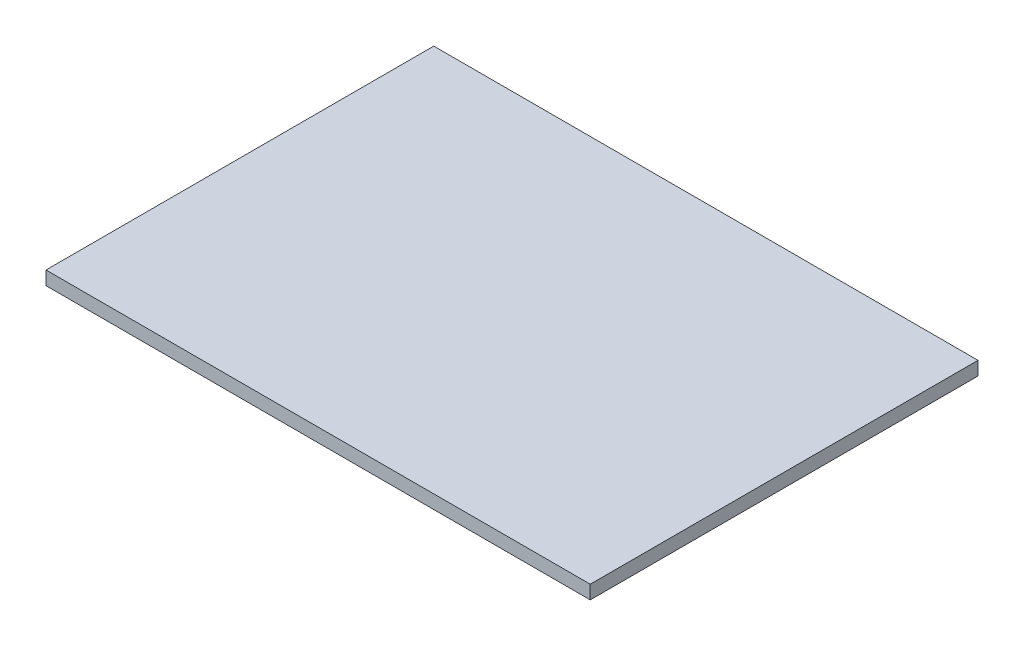
ISO-10303-21;
HEADER;
FILE_DESCRIPTION(('STEP AP214'),'2;1');
FILE_NAME('part.step','',(''),(''),'','','');
FILE_SCHEMA(('AUTOMOTIVE_DESIGN { 1 0 10303 214 1 1 1 1 }'));
ENDSEC;
DATA;
#1=APPLICATION_CONTEXT('core data for automotive mechanical design processes');
#2=APPLICATION_PROTOCOL_DEFINITION('international standard','automotive_design',2000,#1);
#3=PRODUCT_CONTEXT('',#1,'mechanical');
#4=PRODUCT('Part','Part','',(#3));
#5=PRODUCT_RELATED_PRODUCT_CATEGORY('part','',(#4));
#6=PRODUCT_DEFINITION_FORMATION('','',#4);
#7=PRODUCT_DEFINITION_CONTEXT('part definition',#1,'design');
#8=PRODUCT_DEFINITION('design','',#6,#7);
#9=PRODUCT_DEFINITION_SHAPE('','',#8);
#10=(LENGTH_UNIT() NAMED_UNIT(*) SI_UNIT(.MILLI.,.METRE.));
#11=(NAMED_UNIT(*) PLANE_ANGLE_UNIT() SI_UNIT($,.RADIAN.));
#12=(NAMED_UNIT(*) SI_UNIT($,.STERADIAN.) SOLID_ANGLE_UNIT());
#13=UNCERTAINTY_MEASURE_WITH_UNIT(LENGTH_MEASURE(1.E-05),#10,'distance_accuracy_value','');
#14=(GEOMETRIC_REPRESENTATION_CONTEXT(3) GLOBAL_UNCERTAINTY_ASSIGNED_CONTEXT((#13)) GLOBAL_UNIT_ASSIGNED_CONTEXT((#10,
#11,#12)) REPRESENTATION_CONTEXT('',''));
#15=CARTESIAN_POINT('',(0.,0.,0.));
#16=DIRECTION('',(0.,0.,1.));
#17=DIRECTION('',(1.,0.,0.));
#18=AXIS2_PLACEMENT_3D('',#15,#16,#17);
#19=CARTESIAN_POINT('',(400.,20.,285.));
#20=DIRECTION('',(-1.,0.,0.));
#21=DIRECTION('',(0.,0.,1.));
#22=AXIS2_PLACEMENT_3D('',#19,#20,#21);
#23=PLANE('',#22);
#24=DIRECTION('',(0.,0.,-1.));
#25=VECTOR('',#24,1.);
#26=CARTESIAN_POINT('',(400.,0.,285.));
#27=LINE('',#26,#25);
#28=CARTESIAN_POINT('',(400.,0.,285.));
#29=VERTEX_POINT('',#28);
#30=CARTESIAN_POINT('',(400.,0.,-285.));
#31=VERTEX_POINT('',#30);
#32=EDGE_CURVE('E96',#29,#31,#27,.T.);
#33=ORIENTED_EDGE('',*,*,#32,.T.);
#34=DIRECTION('',(0.,-1.,0.));
#35=VECTOR('',#34,1.);
#36=CARTESIAN_POINT('',(400.,20.,-285.));
#37=LINE('',#36,#35);
#38=CARTESIAN_POINT('',(400.,20.,-285.));
#39=VERTEX_POINT('',#38);
#40=EDGE_CURVE('E11',#39,#31,#37,.T.);
#41=ORIENTED_EDGE('',*,*,#40,.F.);
#42=DIRECTION('',(0.,0.,-1.));
#43=VECTOR('',#42,1.);
#44=CARTESIAN_POINT('',(400.,20.,285.));
#45=LINE('',#44,#43);
#46=CARTESIAN_POINT('',(400.,20.,285.));
#47=VERTEX_POINT('',#46);
#48=EDGE_CURVE('E84',#47,#39,#45,.T.);
#49=ORIENTED_EDGE('',*,*,#48,.F.);
#50=DIRECTION('',(0.,-1.,0.));
#51=VECTOR('',#50,1.);
#52=CARTESIAN_POINT('',(400.,20.,285.));
#53=LINE('',#52,#51);
#54=EDGE_CURVE('E92',#47,#29,#53,.T.);
#55=ORIENTED_EDGE('',*,*,#54,.T.);
#56=EDGE_LOOP('',(#33,#41,#49,#55));
#57=FACE_BOUND('',#56,.T.);
#58=ADVANCED_FACE('F33',(#57),#23,.F.);
#59=CARTESIAN_POINT('',(-400.,20.,-285.));
#60=DIRECTION('',(0.,0.,1.));
#61=DIRECTION('',(1.,0.,0.));
#62=AXIS2_PLACEMENT_3D('',#59,#60,#61);
#63=PLANE('',#62);
#64=DIRECTION('',(-1.,0.,0.));
#65=VECTOR('',#64,1.);
#66=CARTESIAN_POINT('',(-400.,0.,-285.));
#67=LINE('',#66,#65);
#68=CARTESIAN_POINT('',(-400.,0.,-285.));
#69=VERTEX_POINT('',#68);
#70=EDGE_CURVE('E88',#31,#69,#67,.T.);
#71=ORIENTED_EDGE('',*,*,#70,.T.);
#72=DIRECTION('',(0.,-1.,0.));
#73=VECTOR('',#72,1.);
#74=CARTESIAN_POINT('',(-400.,20.,-285.));
#75=LINE('',#74,#73);
#76=CARTESIAN_POINT('',(-400.,20.,-285.));
#77=VERTEX_POINT('',#76);
#78=EDGE_CURVE('E41',#77,#69,#75,.T.);
#79=ORIENTED_EDGE('',*,*,#78,.F.);
#80=DIRECTION('',(-1.,0.,0.));
#81=VECTOR('',#80,1.);
#82=CARTESIAN_POINT('',(-400.,20.,-285.));
#83=LINE('',#82,#81);
#84=EDGE_CURVE('E79',#39,#77,#83,.T.);
#85=ORIENTED_EDGE('',*,*,#84,.F.);
#86=ORIENTED_EDGE('',*,*,#40,.T.);
#87=EDGE_LOOP('',(#71,#79,#85,#86));
#88=FACE_BOUND('',#87,.T.);
#89=ADVANCED_FACE('F87',(#88),#63,.F.);
#90=CARTESIAN_POINT('',(-400.,20.,285.));
#91=DIRECTION('',(1.,0.,0.));
#92=DIRECTION('',(0.,0.,-1.));
#93=AXIS2_PLACEMENT_3D('',#90,#91,#92);
#94=PLANE('',#93);
#95=DIRECTION('',(0.,0.,1.));
#96=VECTOR('',#95,1.);
#97=CARTESIAN_POINT('',(-400.,0.,285.));
#98=LINE('',#97,#96);
#99=CARTESIAN_POINT('',(-400.,0.,285.));
#100=VERTEX_POINT('',#99);
#101=EDGE_CURVE('E66',#69,#100,#98,.T.);
#102=ORIENTED_EDGE('',*,*,#101,.T.);
#103=DIRECTION('',(0.,-1.,0.));
#104=VECTOR('',#103,1.);
#105=CARTESIAN_POINT('',(-400.,20.,285.));
#106=LINE('',#105,#104);
#107=CARTESIAN_POINT('',(-400.,20.,285.));
#108=VERTEX_POINT('',#107);
#109=EDGE_CURVE('E89',#108,#100,#106,.T.);
#110=ORIENTED_EDGE('',*,*,#109,.F.);
#111=DIRECTION('',(0.,0.,1.));
#112=VECTOR('',#111,1.);
#113=CARTESIAN_POINT('',(-400.,20.,285.));
#114=LINE('',#113,#112);
#115=EDGE_CURVE('E82',#77,#108,#114,.T.);
#116=ORIENTED_EDGE('',*,*,#115,.F.);
#117=ORIENTED_EDGE('',*,*,#78,.T.);
#118=EDGE_LOOP('',(#102,#110,#116,#117));
#119=FACE_BOUND('',#118,.T.);
#120=ADVANCED_FACE('F90',(#119),#94,.F.);
#121=CARTESIAN_POINT('',(-400.,20.,285.));
#122=DIRECTION('',(0.,0.,-1.));
#123=DIRECTION('',(-1.,0.,0.));
#124=AXIS2_PLACEMENT_3D('',#121,#122,#123);
#125=PLANE('',#124);
#126=DIRECTION('',(1.,0.,0.));
#127=VECTOR('',#126,1.);
#128=CARTESIAN_POINT('',(-400.,0.,285.));
#129=LINE('',#128,#127);
#130=EDGE_CURVE('E72',#100,#29,#129,.T.);
#131=ORIENTED_EDGE('',*,*,#130,.T.);
#132=ORIENTED_EDGE('',*,*,#54,.F.);
#133=DIRECTION('',(1.,0.,0.));
#134=VECTOR('',#133,1.);
#135=CARTESIAN_POINT('',(-400.,20.,285.));
#136=LINE('',#135,#134);
#137=EDGE_CURVE('E49',#108,#47,#136,.T.);
#138=ORIENTED_EDGE('',*,*,#137,.F.);
#139=ORIENTED_EDGE('',*,*,#109,.T.);
#140=EDGE_LOOP('',(#131,#132,#138,#139));
#141=FACE_BOUND('',#140,.T.);
#142=ADVANCED_FACE('F103',(#141),#125,.F.);
#143=CARTESIAN_POINT('',(0.,20.,0.));
#144=DIRECTION('',(0.,-1.,0.));
#145=DIRECTION('',(0.,0.,-1.));
#146=AXIS2_PLACEMENT_3D('',#143,#144,#145);
#147=PLANE('',#146);
#148=ORIENTED_EDGE('',*,*,#48,.T.);
#149=ORIENTED_EDGE('',*,*,#84,.T.);
#150=ORIENTED_EDGE('',*,*,#115,.T.);
#151=ORIENTED_EDGE('',*,*,#137,.T.);
#152=EDGE_LOOP('',(#148,#149,#150,#151));
#153=FACE_BOUND('',#152,.T.);
#154=ADVANCED_FACE('F80',(#153),#147,.F.);
#155=CARTESIAN_POINT('',(0.,0.,0.));
#156=DIRECTION('',(0.,-1.,0.));
#157=DIRECTION('',(0.,0.,-1.));
#158=AXIS2_PLACEMENT_3D('',#155,#156,#157);
#159=PLANE('',#158);
#160=ORIENTED_EDGE('',*,*,#32,.F.);
#161=ORIENTED_EDGE('',*,*,#130,.F.);
#162=ORIENTED_EDGE('',*,*,#101,.F.);
#163=ORIENTED_EDGE('',*,*,#70,.F.);
#164=EDGE_LOOP('',(#160,#161,#162,#163));
#165=FACE_BOUND('',#164,.T.);
#166=ADVANCED_FACE('F106',(#165),#159,.T.);
#167=CLOSED_SHELL('',(#58,#89,#120,#142,#154,#166));
#168=MANIFOLD_SOLID_BREP('B2',#167);
#169=ADVANCED_BREP_SHAPE_REPRESENTATION('',(#18,#168),#14);
#170=SHAPE_DEFINITION_REPRESENTATION(#9,#169);
ENDSEC;
END-ISO-10303-21;
